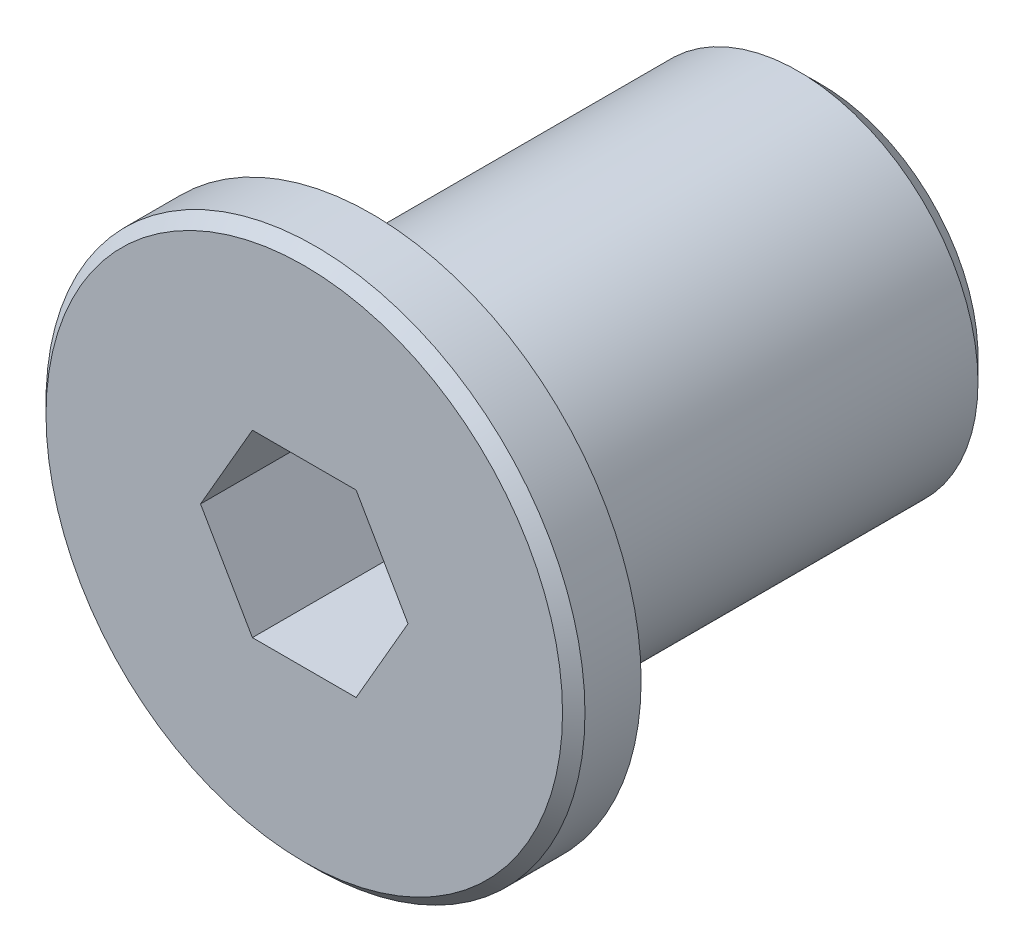
ISO-10303-21;
HEADER;
FILE_DESCRIPTION(('STEP AP214'),'2;1');
FILE_NAME('part.step','',(''),(''),'','','');
FILE_SCHEMA(('AUTOMOTIVE_DESIGN { 1 0 10303 214 1 1 1 1 }'));
ENDSEC;
DATA;
#1=APPLICATION_CONTEXT('core data for automotive mechanical design processes');
#2=APPLICATION_PROTOCOL_DEFINITION('international standard','automotive_design',2000,#1);
#3=PRODUCT_CONTEXT('',#1,'mechanical');
#4=PRODUCT('Part','Part','',(#3));
#5=PRODUCT_RELATED_PRODUCT_CATEGORY('part','',(#4));
#6=PRODUCT_DEFINITION_FORMATION('','',#4);
#7=PRODUCT_DEFINITION_CONTEXT('part definition',#1,'design');
#8=PRODUCT_DEFINITION('design','',#6,#7);
#9=PRODUCT_DEFINITION_SHAPE('','',#8);
#10=(LENGTH_UNIT() NAMED_UNIT(*) SI_UNIT(.MILLI.,.METRE.));
#11=(NAMED_UNIT(*) PLANE_ANGLE_UNIT() SI_UNIT($,.RADIAN.));
#12=(NAMED_UNIT(*) SI_UNIT($,.STERADIAN.) SOLID_ANGLE_UNIT());
#13=UNCERTAINTY_MEASURE_WITH_UNIT(LENGTH_MEASURE(1.E-05),#10,'distance_accuracy_value','');
#14=(GEOMETRIC_REPRESENTATION_CONTEXT(3) GLOBAL_UNCERTAINTY_ASSIGNED_CONTEXT((#13)) GLOBAL_UNIT_ASSIGNED_CONTEXT((#10,
#11,#12)) REPRESENTATION_CONTEXT('',''));
#15=CARTESIAN_POINT('',(0.,0.,0.));
#16=DIRECTION('',(0.,0.,1.));
#17=DIRECTION('',(1.,0.,0.));
#18=AXIS2_PLACEMENT_3D('',#15,#16,#17);
#19=CARTESIAN_POINT('',(0.,0.,-5.));
#20=DIRECTION('',(0.,0.,1.));
#21=DIRECTION('',(1.,0.,0.));
#22=AXIS2_PLACEMENT_3D('',#19,#20,#21);
#23=PLANE('',#22);
#24=DIRECTION('',(-0.499999999999999,0.866025403784439,0.));
#25=VECTOR('',#24,1.);
#26=CARTESIAN_POINT('',(1.73205080756888,1.,-5.));
#27=LINE('',#26,#25);
#28=CARTESIAN_POINT('',(1.73205080756888,1.,-5.));
#29=VERTEX_POINT('',#28);
#30=CARTESIAN_POINT('',(1.15470053837925,2.,-5.));
#31=VERTEX_POINT('',#30);
#32=EDGE_CURVE('E164',#29,#31,#27,.T.);
#33=ORIENTED_EDGE('',*,*,#32,.T.);
#34=DIRECTION('',(1.,0.,0.));
#35=VECTOR('',#34,1.);
#36=CARTESIAN_POINT('',(0.,2.,-5.));
#37=LINE('',#36,#35);
#38=CARTESIAN_POINT('',(0.,2.,-5.));
#39=VERTEX_POINT('',#38);
#40=EDGE_CURVE('E162',#31,#39,#37,.F.);
#41=ORIENTED_EDGE('',*,*,#40,.T.);
#42=CARTESIAN_POINT('',(0.,0.,-5.));
#43=DIRECTION('',(0.,0.,1.));
#44=DIRECTION('',(0.,-1.,0.));
#45=AXIS2_PLACEMENT_3D('',#42,#43,#44);
#46=CIRCLE('',#45,2.);
#47=EDGE_CURVE('E125',#39,#29,#46,.F.);
#48=ORIENTED_EDGE('',*,*,#47,.T.);
#49=EDGE_LOOP('',(#33,#41,#48));
#50=FACE_BOUND('',#49,.T.);
#51=ADVANCED_FACE('F15',(#50),#23,.T.);
#52=CARTESIAN_POINT('',(0.,0.,-5.));
#53=DIRECTION('',(0.,0.,1.));
#54=DIRECTION('',(1.,0.,0.));
#55=AXIS2_PLACEMENT_3D('',#52,#53,#54);
#56=PLANE('',#55);
#57=DIRECTION('',(0.5,0.866025403784439,0.));
#58=VECTOR('',#57,1.);
#59=CARTESIAN_POINT('',(1.73205080756888,-1.,-5.));
#60=LINE('',#59,#58);
#61=CARTESIAN_POINT('',(1.73205080756888,-1.,-5.));
#62=VERTEX_POINT('',#61);
#63=CARTESIAN_POINT('',(2.3094010767585,0.,-5.));
#64=VERTEX_POINT('',#63);
#65=EDGE_CURVE('E54',#62,#64,#60,.T.);
#66=ORIENTED_EDGE('',*,*,#65,.T.);
#67=DIRECTION('',(-0.5,0.866025403784438,0.));
#68=VECTOR('',#67,1.);
#69=CARTESIAN_POINT('',(2.3094010767585,0.,-5.));
#70=LINE('',#69,#68);
#71=EDGE_CURVE('E159',#64,#29,#70,.T.);
#72=ORIENTED_EDGE('',*,*,#71,.T.);
#73=CARTESIAN_POINT('',(0.,0.,-5.));
#74=DIRECTION('',(0.,0.,1.));
#75=DIRECTION('',(0.,-1.,0.));
#76=AXIS2_PLACEMENT_3D('',#73,#74,#75);
#77=CIRCLE('',#76,2.);
#78=EDGE_CURVE('E124',#29,#62,#77,.F.);
#79=ORIENTED_EDGE('',*,*,#78,.T.);
#80=EDGE_LOOP('',(#66,#72,#79));
#81=FACE_BOUND('',#80,.T.);
#82=ADVANCED_FACE('F313',(#81),#56,.T.);
#83=CARTESIAN_POINT('',(0.,0.,-5.));
#84=DIRECTION('',(0.,0.,1.));
#85=DIRECTION('',(1.,0.,0.));
#86=AXIS2_PLACEMENT_3D('',#83,#84,#85);
#87=PLANE('',#86);
#88=DIRECTION('',(0.499999999999999,-0.866025403784439,0.));
#89=VECTOR('',#88,1.);
#90=CARTESIAN_POINT('',(-1.73205080756888,-1.,-5.));
#91=LINE('',#90,#89);
#92=CARTESIAN_POINT('',(-1.73205080756888,-1.,-5.));
#93=VERTEX_POINT('',#92);
#94=CARTESIAN_POINT('',(-1.15470053837925,-2.,-5.));
#95=VERTEX_POINT('',#94);
#96=EDGE_CURVE('E156',#93,#95,#91,.T.);
#97=ORIENTED_EDGE('',*,*,#96,.T.);
#98=DIRECTION('',(1.,0.,0.));
#99=VECTOR('',#98,1.);
#100=CARTESIAN_POINT('',(0.,-2.,-5.));
#101=LINE('',#100,#99);
#102=CARTESIAN_POINT('',(0.,-2.,-5.));
#103=VERTEX_POINT('',#102);
#104=EDGE_CURVE('E154',#95,#103,#101,.T.);
#105=ORIENTED_EDGE('',*,*,#104,.T.);
#106=CARTESIAN_POINT('',(0.,0.,-5.));
#107=DIRECTION('',(0.,0.,1.));
#108=DIRECTION('',(0.,-1.,0.));
#109=AXIS2_PLACEMENT_3D('',#106,#107,#108);
#110=CIRCLE('',#109,2.);
#111=EDGE_CURVE('E121',#103,#93,#110,.F.);
#112=ORIENTED_EDGE('',*,*,#111,.T.);
#113=EDGE_LOOP('',(#97,#105,#112));
#114=FACE_BOUND('',#113,.T.);
#115=ADVANCED_FACE('F308',(#114),#87,.T.);
#116=CARTESIAN_POINT('',(0.,0.,-5.));
#117=DIRECTION('',(0.,0.,1.));
#118=DIRECTION('',(1.,0.,0.));
#119=AXIS2_PLACEMENT_3D('',#116,#117,#118);
#120=PLANE('',#119);
#121=DIRECTION('',(-0.5,-0.866025403784438,0.));
#122=VECTOR('',#121,1.);
#123=CARTESIAN_POINT('',(-1.73205080756888,1.,-5.));
#124=LINE('',#123,#122);
#125=CARTESIAN_POINT('',(-1.73205080756888,1.,-5.));
#126=VERTEX_POINT('',#125);
#127=CARTESIAN_POINT('',(-2.3094010767585,0.,-5.));
#128=VERTEX_POINT('',#127);
#129=EDGE_CURVE('E151',#126,#128,#124,.T.);
#130=ORIENTED_EDGE('',*,*,#129,.T.);
#131=DIRECTION('',(0.5,-0.866025403784438,0.));
#132=VECTOR('',#131,1.);
#133=CARTESIAN_POINT('',(-2.3094010767585,0.,-5.));
#134=LINE('',#133,#132);
#135=EDGE_CURVE('E139',#128,#93,#134,.T.);
#136=ORIENTED_EDGE('',*,*,#135,.T.);
#137=CARTESIAN_POINT('',(0.,0.,-5.));
#138=DIRECTION('',(0.,0.,1.));
#139=DIRECTION('',(0.,-1.,0.));
#140=AXIS2_PLACEMENT_3D('',#137,#138,#139);
#141=CIRCLE('',#140,2.);
#142=EDGE_CURVE('E116',#93,#126,#141,.F.);
#143=ORIENTED_EDGE('',*,*,#142,.T.);
#144=EDGE_LOOP('',(#130,#136,#143));
#145=FACE_BOUND('',#144,.T.);
#146=ADVANCED_FACE('F306',(#145),#120,.T.);
#147=CARTESIAN_POINT('',(0.,0.,-5.));
#148=DIRECTION('',(0.,0.,1.));
#149=DIRECTION('',(1.,0.,0.));
#150=AXIS2_PLACEMENT_3D('',#147,#148,#149);
#151=PLANE('',#150);
#152=DIRECTION('',(1.,0.,0.));
#153=VECTOR('',#152,1.);
#154=CARTESIAN_POINT('',(0.,2.,-5.));
#155=LINE('',#154,#153);
#156=CARTESIAN_POINT('',(-1.15470053837925,2.,-5.));
#157=VERTEX_POINT('',#156);
#158=EDGE_CURVE('E134',#39,#157,#155,.F.);
#159=ORIENTED_EDGE('',*,*,#158,.T.);
#160=DIRECTION('',(-0.5,-0.866025403784439,0.));
#161=VECTOR('',#160,1.);
#162=CARTESIAN_POINT('',(-1.15470053837925,2.,-5.));
#163=LINE('',#162,#161);
#164=EDGE_CURVE('E127',#157,#126,#163,.T.);
#165=ORIENTED_EDGE('',*,*,#164,.T.);
#166=CARTESIAN_POINT('',(0.,0.,-5.));
#167=DIRECTION('',(0.,0.,1.));
#168=DIRECTION('',(0.,-1.,0.));
#169=AXIS2_PLACEMENT_3D('',#166,#167,#168);
#170=CIRCLE('',#169,2.);
#171=EDGE_CURVE('E113',#126,#39,#170,.F.);
#172=ORIENTED_EDGE('',*,*,#171,.T.);
#173=EDGE_LOOP('',(#159,#165,#172));
#174=FACE_BOUND('',#173,.T.);
#175=ADVANCED_FACE('F287',(#174),#151,.T.);
#176=CARTESIAN_POINT('',(0.,0.250000000000001,-6.5));
#177=DIRECTION('',(0.,0.,-1.));
#178=DIRECTION('',(-1.,0.,0.));
#179=AXIS2_PLACEMENT_3D('',#176,#177,#178);
#180=PLANE('',#179);
#181=CARTESIAN_POINT('',(0.,0.,-6.5));
#182=DIRECTION('',(0.,0.,1.));
#183=DIRECTION('',(0.,-1.,0.));
#184=AXIS2_PLACEMENT_3D('',#181,#182,#183);
#185=CIRCLE('',#184,0.500000000000001);
#186=CARTESIAN_POINT('',(0.,0.500000000000001,-6.5));
#187=VERTEX_POINT('',#186);
#188=EDGE_CURVE('E60',#187,#187,#185,.T.);
#189=ORIENTED_EDGE('',*,*,#188,.T.);
#190=EDGE_LOOP('',(#189));
#191=FACE_BOUND('',#190,.T.);
#192=ADVANCED_FACE('F271',(#191),#180,.F.);
#193=CARTESIAN_POINT('',(0.,2.,-5.));
#194=CARTESIAN_POINT('',(0.,1.47070709916903,-6.19091513246404));
#195=CARTESIAN_POINT('',(0.,0.500000000000001,-6.5));
#196=(BOUNDED_CURVE() B_SPLINE_CURVE(2,(#193,#194,#195),.UNSPECIFIED.,.F.,
.F.) B_SPLINE_CURVE_WITH_KNOTS((3,3),(0.,0.459388320020566),
.UNSPECIFIED.) CURVE() GEOMETRIC_REPRESENTATION_ITEM() RATIONAL_B_SPLINE_CURVE((1.,1.,1.)) REPRESENTATION_ITEM(''));
#197=CARTESIAN_POINT('',(0.,0.,-6.5));
#198=DIRECTION('',(0.,0.,1.));
#199=AXIS1_PLACEMENT('',#197,#198);
#200=SURFACE_OF_REVOLUTION('',#196,#199);
#201=ORIENTED_EDGE('',*,*,#188,.F.);
#202=CARTESIAN_POINT('',(0.,2.,-5.));
#203=CARTESIAN_POINT('',(0.,1.97827182619173,-5.04888240871449));
#204=CARTESIAN_POINT('',(0.,1.95566558006333,-5.09738320406536));
#205=CARTESIAN_POINT('',(0.,1.90924750218105,-5.19205941996444));
#206=CARTESIAN_POINT('',(0.,1.88548984352403,-5.23826144832604));
#207=CARTESIAN_POINT('',(0.,1.83677019123873,-5.32834337707176));
#208=CARTESIAN_POINT('',(0.,1.81186145011461,-5.3722519744186));
#209=CARTESIAN_POINT('',(0.,1.76084050483905,-5.45774340043139));
#210=CARTESIAN_POINT('',(0.,1.73477996335951,-5.49935699073731));
#211=CARTESIAN_POINT('',(0.,1.6814572947538,-5.58025681634127));
#212=CARTESIAN_POINT('',(0.,1.65424445703679,-5.61957545842493));
#213=CARTESIAN_POINT('',(0.,1.59861983381496,-5.69588374907246));
#214=CARTESIAN_POINT('',(0.,1.57025413740641,-5.73290691641974));
#215=CARTESIAN_POINT('',(0.,1.51232729538913,-5.80462334879223));
#216=CARTESIAN_POINT('',(0.,1.48280819753971,-5.83935050128348));
#217=CARTESIAN_POINT('',(0.,1.42257900760656,-5.90647470967855));
#218=CARTESIAN_POINT('',(0.,1.39190612070068,-5.93890508238314));
#219=CARTESIAN_POINT('',(0.,1.32937429317669,-6.00143673695821));
#220=CARTESIAN_POINT('',(0.,1.29754703010189,-6.03156963172105));
#221=CARTESIAN_POINT('',(0.,1.23271325795719,-6.08950782814783));
#222=CARTESIAN_POINT('',(0.,1.1997323684979,-6.11734177070918));
#223=CARTESIAN_POINT('',(0.,1.13259429865741,-6.17068740496834));
#224=CARTESIAN_POINT('',(0.,1.09845647742931,-6.19622336773438));
#225=CARTESIAN_POINT('',(0.,1.0462714232118,-6.23286121671812));
#226=CARTESIAN_POINT('',(0.,1.02877692942351,-6.24475698448814));
#227=CARTESIAN_POINT('',(0.,0.993498546966384,-6.26797271454702));
#228=CARTESIAN_POINT('',(0.,0.975715914658029,-6.2792945811534));
#229=CARTESIAN_POINT('',(0.,0.939862259026094,-6.30136231719819));
#230=CARTESIAN_POINT('',(0.,0.921792130786073,-6.31210964156172));
#231=CARTESIAN_POINT('',(0.,0.885363675176823,-6.33302891879935));
#232=CARTESIAN_POINT('',(0.,0.867005905754607,-6.34320184299462));
#233=CARTESIAN_POINT('',(0.,0.830002547961604,-6.36297276652363));
#234=CARTESIAN_POINT('',(0.,0.811357206016257,-6.37257122706531));
#235=CARTESIAN_POINT('',(0.,0.773778999499796,-6.3911937540134));
#236=CARTESIAN_POINT('',(0.,0.754846099952507,-6.40021774984228));
#237=CARTESIAN_POINT('',(0.,0.716693057730008,-6.41769187140308));
#238=CARTESIAN_POINT('',(0.,0.697472632008254,-6.4261413790729));
#239=CARTESIAN_POINT('',(0.,0.658744780295542,-6.44246710936987));
#240=CARTESIAN_POINT('',(0.,0.639236859070804,-6.45034215707015));
#241=CARTESIAN_POINT('',(0.,0.599934216251847,-6.46551939673935));
#242=CARTESIAN_POINT('',(0.,0.580138824832327,-6.47281985347101));
#243=CARTESIAN_POINT('',(0.,0.540261429737367,-6.48684894907975));
#244=CARTESIAN_POINT('',(0.,0.520178620235151,-6.49357529786835));
#245=CARTESIAN_POINT('',(0.,0.500000000000001,-6.5));
#246=B_SPLINE_CURVE_WITH_KNOTS('',3,(#202,#203,#204,#205,#206,#207,#208,#209,#210,#211,#212,
#213,#214,#215,#216,#217,#218,#219,#220,#221,#222,#223,#224,#225,#226,#227,#228,#229,#230,#231,
#232,#233,#234,#235,#236,#237,#238,#239,#240,#241,#242,#243,#244,#245),.UNSPECIFIED.,.F.,.F.,(4,
2,2,2,2,2,2,2,2,2,2,2,2,2,2,2,2,2,2,2,2,4),(0.,0.160484874729874,0.31630299090354,
0.467702744837059,0.614954894249969,0.758353692622503,0.898217716213365,1.03489026161929,
1.16873918426277,1.3001560529299,1.4295545169861,1.55736782412704,1.62082716949787,
1.68405992592196,1.74712412987997,1.81007828401216,1.87298119801393,1.93589182528073,
1.99886909754671,2.06197175982651,2.12525820795964,2.1887863309729),.UNSPECIFIED.);
#247=EDGE_CURVE('E110',#39,#187,#246,.T.);
#248=ORIENTED_EDGE('',*,*,#247,.F.);
#249=ORIENTED_EDGE('',*,*,#171,.F.);
#250=ORIENTED_EDGE('',*,*,#142,.F.);
#251=ORIENTED_EDGE('',*,*,#111,.F.);
#252=CARTESIAN_POINT('',(0.,0.,-5.));
#253=DIRECTION('',(0.,0.,1.));
#254=DIRECTION('',(0.,-1.,0.));
#255=AXIS2_PLACEMENT_3D('',#252,#253,#254);
#256=CIRCLE('',#255,2.);
#257=EDGE_CURVE('E105',#62,#103,#256,.F.);
#258=ORIENTED_EDGE('',*,*,#257,.F.);
#259=ORIENTED_EDGE('',*,*,#78,.F.);
#260=ORIENTED_EDGE('',*,*,#47,.F.);
#261=ORIENTED_EDGE('',*,*,#247,.T.);
#262=EDGE_LOOP('',(#201,#248,#249,#250,#251,#258,#259,#260,#261));
#263=FACE_BOUND('',#262,.T.);
#264=ADVANCED_FACE('F265',(#263),#200,.T.);
#265=CARTESIAN_POINT('',(0.,0.,-5.));
#266=DIRECTION('',(0.,0.,1.));
#267=DIRECTION('',(1.,0.,0.));
#268=AXIS2_PLACEMENT_3D('',#265,#266,#267);
#269=PLANE('',#268);
#270=DIRECTION('',(1.,0.,0.));
#271=VECTOR('',#270,1.);
#272=CARTESIAN_POINT('',(-1.15470053837925,-2.,-5.));
#273=LINE('',#272,#271);
#274=CARTESIAN_POINT('',(1.15470053837925,-2.,-5.));
#275=VERTEX_POINT('',#274);
#276=EDGE_CURVE('E180',#103,#275,#273,.T.);
#277=ORIENTED_EDGE('',*,*,#276,.T.);
#278=DIRECTION('',(0.5,0.866025403784439,0.));
#279=VECTOR('',#278,1.);
#280=CARTESIAN_POINT('',(1.15470053837925,-2.,-5.));
#281=LINE('',#280,#279);
#282=EDGE_CURVE('E108',#275,#62,#281,.T.);
#283=ORIENTED_EDGE('',*,*,#282,.T.);
#284=ORIENTED_EDGE('',*,*,#257,.T.);
#285=EDGE_LOOP('',(#277,#283,#284));
#286=FACE_BOUND('',#285,.T.);
#287=ADVANCED_FACE('F270',(#286),#269,.T.);
#288=CARTESIAN_POINT('',(-2.3094010767585,0.,0.));
#289=DIRECTION('',(-0.866025403784439,-0.5,0.));
#290=DIRECTION('',(0.5,-0.866025403784439,0.));
#291=AXIS2_PLACEMENT_3D('',#288,#289,#290);
#292=PLANE('',#291);
#293=DIRECTION('',(0.,0.,1.));
#294=VECTOR('',#293,1.);
#295=CARTESIAN_POINT('',(-2.3094010767585,0.,0.));
#296=LINE('',#295,#294);
#297=CARTESIAN_POINT('',(-2.3094010767585,0.,0.));
#298=VERTEX_POINT('',#297);
#299=EDGE_CURVE('E172',#128,#298,#296,.T.);
#300=ORIENTED_EDGE('',*,*,#299,.T.);
#301=DIRECTION('',(0.5,-0.866025403784439,0.));
#302=VECTOR('',#301,1.);
#303=CARTESIAN_POINT('',(-2.3094010767585,0.,0.));
#304=LINE('',#303,#302);
#305=CARTESIAN_POINT('',(-1.15470053837925,-2.,0.));
#306=VERTEX_POINT('',#305);
#307=EDGE_CURVE('E171',#298,#306,#304,.T.);
#308=ORIENTED_EDGE('',*,*,#307,.T.);
#309=DIRECTION('',(0.,0.,-1.));
#310=VECTOR('',#309,1.);
#311=CARTESIAN_POINT('',(-1.15470053837925,-2.,0.));
#312=LINE('',#311,#310);
#313=EDGE_CURVE('E176',#306,#95,#312,.T.);
#314=ORIENTED_EDGE('',*,*,#313,.T.);
#315=ORIENTED_EDGE('',*,*,#96,.F.);
#316=ORIENTED_EDGE('',*,*,#135,.F.);
#317=EDGE_LOOP('',(#300,#308,#314,#315,#316));
#318=FACE_BOUND('',#317,.T.);
#319=ADVANCED_FACE('F228',(#318),#292,.F.);
#320=CARTESIAN_POINT('',(-1.15470053837925,-2.,0.));
#321=DIRECTION('',(0.,-1.,0.));
#322=DIRECTION('',(0.,0.,-1.));
#323=AXIS2_PLACEMENT_3D('',#320,#321,#322);
#324=PLANE('',#323);
#325=ORIENTED_EDGE('',*,*,#313,.F.);
#326=DIRECTION('',(-1.,0.,0.));
#327=VECTOR('',#326,1.);
#328=CARTESIAN_POINT('',(0.,-2.,0.));
#329=LINE('',#328,#327);
#330=CARTESIAN_POINT('',(1.15470053837925,-2.,0.));
#331=VERTEX_POINT('',#330);
#332=EDGE_CURVE('E234',#306,#331,#329,.F.);
#333=ORIENTED_EDGE('',*,*,#332,.T.);
#334=DIRECTION('',(0.,0.,1.));
#335=VECTOR('',#334,1.);
#336=CARTESIAN_POINT('',(1.15470053837925,-2.,0.));
#337=LINE('',#336,#335);
#338=EDGE_CURVE('E179',#331,#275,#337,.F.);
#339=ORIENTED_EDGE('',*,*,#338,.T.);
#340=ORIENTED_EDGE('',*,*,#276,.F.);
#341=ORIENTED_EDGE('',*,*,#104,.F.);
#342=EDGE_LOOP('',(#325,#333,#339,#340,#341));
#343=FACE_BOUND('',#342,.T.);
#344=ADVANCED_FACE('F237',(#343),#324,.F.);
#345=CARTESIAN_POINT('',(1.15470053837925,-2.,0.));
#346=DIRECTION('',(0.866025403784439,-0.5,0.));
#347=DIRECTION('',(0.5,0.866025403784439,0.));
#348=AXIS2_PLACEMENT_3D('',#345,#346,#347);
#349=PLANE('',#348);
#350=ORIENTED_EDGE('',*,*,#338,.F.);
#351=DIRECTION('',(0.5,0.866025403784439,0.));
#352=VECTOR('',#351,1.);
#353=CARTESIAN_POINT('',(1.15470053837925,-2.,0.));
#354=LINE('',#353,#352);
#355=CARTESIAN_POINT('',(2.3094010767585,0.,0.));
#356=VERTEX_POINT('',#355);
#357=EDGE_CURVE('E245',#331,#356,#354,.T.);
#358=ORIENTED_EDGE('',*,*,#357,.T.);
#359=DIRECTION('',(0.,0.,1.));
#360=VECTOR('',#359,1.);
#361=CARTESIAN_POINT('',(2.3094010767585,0.,0.));
#362=LINE('',#361,#360);
#363=EDGE_CURVE('E181',#356,#64,#362,.F.);
#364=ORIENTED_EDGE('',*,*,#363,.T.);
#365=ORIENTED_EDGE('',*,*,#65,.F.);
#366=ORIENTED_EDGE('',*,*,#282,.F.);
#367=EDGE_LOOP('',(#350,#358,#364,#365,#366));
#368=FACE_BOUND('',#367,.T.);
#369=ADVANCED_FACE('F311',(#368),#349,.F.);
#370=CARTESIAN_POINT('',(2.3094010767585,0.,0.));
#371=DIRECTION('',(0.866025403784439,0.5,0.));
#372=DIRECTION('',(-0.5,0.866025403784439,0.));
#373=AXIS2_PLACEMENT_3D('',#370,#371,#372);
#374=PLANE('',#373);
#375=ORIENTED_EDGE('',*,*,#363,.F.);
#376=DIRECTION('',(-0.5,0.866025403784439,0.));
#377=VECTOR('',#376,1.);
#378=CARTESIAN_POINT('',(2.3094010767585,0.,0.));
#379=LINE('',#378,#377);
#380=CARTESIAN_POINT('',(1.15470053837925,2.,0.));
#381=VERTEX_POINT('',#380);
#382=EDGE_CURVE('E247',#356,#381,#379,.T.);
#383=ORIENTED_EDGE('',*,*,#382,.T.);
#384=DIRECTION('',(0.,0.,1.));
#385=VECTOR('',#384,1.);
#386=CARTESIAN_POINT('',(1.15470053837925,2.,0.));
#387=LINE('',#386,#385);
#388=EDGE_CURVE('E175',#381,#31,#387,.F.);
#389=ORIENTED_EDGE('',*,*,#388,.T.);
#390=ORIENTED_EDGE('',*,*,#32,.F.);
#391=ORIENTED_EDGE('',*,*,#71,.F.);
#392=EDGE_LOOP('',(#375,#383,#389,#390,#391));
#393=FACE_BOUND('',#392,.T.);
#394=ADVANCED_FACE('F295',(#393),#374,.F.);
#395=CARTESIAN_POINT('',(1.15470053837925,2.,0.));
#396=DIRECTION('',(0.,1.,0.));
#397=DIRECTION('',(0.,0.,1.));
#398=AXIS2_PLACEMENT_3D('',#395,#396,#397);
#399=PLANE('',#398);
#400=ORIENTED_EDGE('',*,*,#388,.F.);
#401=DIRECTION('',(-1.,0.,0.));
#402=VECTOR('',#401,1.);
#403=CARTESIAN_POINT('',(0.,2.,0.));
#404=LINE('',#403,#402);
#405=CARTESIAN_POINT('',(-1.15470053837925,2.,0.));
#406=VERTEX_POINT('',#405);
#407=EDGE_CURVE('E296',#381,#406,#404,.T.);
#408=ORIENTED_EDGE('',*,*,#407,.T.);
#409=DIRECTION('',(0.,0.,1.));
#410=VECTOR('',#409,1.);
#411=CARTESIAN_POINT('',(-1.15470053837925,2.,0.));
#412=LINE('',#411,#410);
#413=EDGE_CURVE('E168',#406,#157,#412,.F.);
#414=ORIENTED_EDGE('',*,*,#413,.T.);
#415=ORIENTED_EDGE('',*,*,#158,.F.);
#416=ORIENTED_EDGE('',*,*,#40,.F.);
#417=EDGE_LOOP('',(#400,#408,#414,#415,#416));
#418=FACE_BOUND('',#417,.T.);
#419=ADVANCED_FACE('F290',(#418),#399,.F.);
#420=CARTESIAN_POINT('',(-1.15470053837925,2.,0.));
#421=DIRECTION('',(-0.866025403784439,0.5,0.));
#422=DIRECTION('',(-0.5,-0.866025403784439,0.));
#423=AXIS2_PLACEMENT_3D('',#420,#421,#422);
#424=PLANE('',#423);
#425=ORIENTED_EDGE('',*,*,#413,.F.);
#426=DIRECTION('',(-0.5,-0.866025403784439,0.));
#427=VECTOR('',#426,1.);
#428=CARTESIAN_POINT('',(-1.15470053837925,2.,0.));
#429=LINE('',#428,#427);
#430=EDGE_CURVE('E104',#406,#298,#429,.T.);
#431=ORIENTED_EDGE('',*,*,#430,.T.);
#432=ORIENTED_EDGE('',*,*,#299,.F.);
#433=ORIENTED_EDGE('',*,*,#129,.F.);
#434=ORIENTED_EDGE('',*,*,#164,.F.);
#435=EDGE_LOOP('',(#425,#431,#432,#433,#434));
#436=FACE_BOUND('',#435,.T.);
#437=ADVANCED_FACE('F304',(#436),#424,.F.);
#438=CARTESIAN_POINT('',(0.,0.,0.));
#439=DIRECTION('',(0.,0.,-1.));
#440=DIRECTION('',(-1.,0.,0.));
#441=AXIS2_PLACEMENT_3D('',#438,#439,#440);
#442=PLANE('',#441);
#443=ORIENTED_EDGE('',*,*,#407,.F.);
#444=ORIENTED_EDGE('',*,*,#382,.F.);
#445=ORIENTED_EDGE('',*,*,#357,.F.);
#446=ORIENTED_EDGE('',*,*,#332,.F.);
#447=ORIENTED_EDGE('',*,*,#307,.F.);
#448=ORIENTED_EDGE('',*,*,#430,.F.);
#449=EDGE_LOOP('',(#443,#444,#445,#446,#447,#448));
#450=FACE_BOUND('',#449,.T.);
#451=CARTESIAN_POINT('',(0.,0.,1.13686837721616E-10));
#452=DIRECTION('',(0.,0.,-1.));
#453=DIRECTION('',(-1.,0.,0.));
#454=AXIS2_PLACEMENT_3D('',#451,#452,#453);
#455=CIRCLE('',#454,5.7500000000914);
#456=CARTESIAN_POINT('',(5.7500000000914,0.,1.13686837721616E-10));
#457=VERTEX_POINT('',#456);
#458=EDGE_CURVE('E31',#457,#457,#455,.T.);
#459=ORIENTED_EDGE('',*,*,#458,.F.);
#460=EDGE_LOOP('',(#459));
#461=FACE_BOUND('',#460,.T.);
#462=ADVANCED_FACE('F243',(#450,#461),#442,.F.);
#463=CARTESIAN_POINT('',(0.,0.,-0.250000000164619));
#464=DIRECTION('',(0.,0.,-1.));
#465=DIRECTION('',(-1.,0.,0.));
#466=AXIS2_PLACEMENT_3D('',#463,#464,#465);
#467=CONICAL_SURFACE('',#466,5.99999999991496,0.785398162487954);
#468=CARTESIAN_POINT('',(0.,0.,-0.25));
#469=DIRECTION('',(0.,0.,-1.));
#470=DIRECTION('',(-1.,0.,0.));
#471=AXIS2_PLACEMENT_3D('',#468,#469,#470);
#472=CIRCLE('',#471,6.);
#473=CARTESIAN_POINT('',(5.99999999995748,0.,-0.250000000082309));
#474=VERTEX_POINT('',#473);
#475=EDGE_CURVE('E96',#474,#474,#472,.T.);
#476=ORIENTED_EDGE('',*,*,#475,.F.);
#477=EDGE_LOOP('',(#476));
#478=FACE_BOUND('',#477,.T.);
#479=ORIENTED_EDGE('',*,*,#458,.T.);
#480=EDGE_LOOP('',(#479));
#481=FACE_BOUND('',#480,.T.);
#482=ADVANCED_FACE('F381',(#478,#481),#467,.T.);
#483=CARTESIAN_POINT('',(0.,0.,0.));
#484=DIRECTION('',(0.,0.,-1.));
#485=DIRECTION('',(-1.,0.,0.));
#486=AXIS2_PLACEMENT_3D('',#483,#484,#485);
#487=CYLINDRICAL_SURFACE('',#486,6.);
#488=ORIENTED_EDGE('',*,*,#475,.T.);
#489=EDGE_LOOP('',(#488));
#490=FACE_BOUND('',#489,.T.);
#491=CARTESIAN_POINT('',(0.,0.,-1.5));
#492=DIRECTION('',(0.,0.,-1.));
#493=DIRECTION('',(-1.,0.,0.));
#494=AXIS2_PLACEMENT_3D('',#491,#492,#493);
#495=CIRCLE('',#494,6.);
#496=CARTESIAN_POINT('',(6.,0.,-1.5));
#497=VERTEX_POINT('',#496);
#498=EDGE_CURVE('E93',#497,#497,#495,.T.);
#499=ORIENTED_EDGE('',*,*,#498,.F.);
#500=EDGE_LOOP('',(#499));
#501=FACE_BOUND('',#500,.T.);
#502=ADVANCED_FACE('F94',(#490,#501),#487,.T.);
#503=CARTESIAN_POINT('',(0.,0.,-11.5));
#504=DIRECTION('',(0.,0.,1.));
#505=DIRECTION('',(1.,0.,0.));
#506=AXIS2_PLACEMENT_3D('',#503,#504,#505);
#507=PLANE('',#506);
#508=CARTESIAN_POINT('',(0.,0.,-11.5000000001828));
#509=DIRECTION('',(0.,0.,1.));
#510=DIRECTION('',(1.,0.,0.));
#511=AXIS2_PLACEMENT_3D('',#508,#509,#510);
#512=CIRCLE('',#511,3.50000000020145);
#513=CARTESIAN_POINT('',(-3.50000000020145,0.,-11.5000000001828));
#514=VERTEX_POINT('',#513);
#515=EDGE_CURVE('E89',#514,#514,#512,.T.);
#516=ORIENTED_EDGE('',*,*,#515,.F.);
#517=EDGE_LOOP('',(#516));
#518=FACE_BOUND('',#517,.T.);
#519=ADVANCED_FACE('F191',(#518),#507,.F.);
#520=CARTESIAN_POINT('',(0.,0.,-1.5));
#521=DIRECTION('',(0.,0.,-1.));
#522=DIRECTION('',(-1.,0.,0.));
#523=AXIS2_PLACEMENT_3D('',#520,#521,#522);
#524=PLANE('',#523);
#525=CARTESIAN_POINT('',(0.,0.,-1.5));
#526=DIRECTION('',(0.,0.,-1.));
#527=DIRECTION('',(-1.,0.,0.));
#528=AXIS2_PLACEMENT_3D('',#525,#526,#527);
#529=CIRCLE('',#528,4.);
#530=CARTESIAN_POINT('',(-4.,0.,-1.5));
#531=VERTEX_POINT('',#530);
#532=EDGE_CURVE('E24',#531,#531,#529,.T.);
#533=ORIENTED_EDGE('',*,*,#532,.F.);
#534=EDGE_LOOP('',(#533));
#535=FACE_BOUND('',#534,.T.);
#536=ORIENTED_EDGE('',*,*,#498,.T.);
#537=EDGE_LOOP('',(#536));
#538=FACE_BOUND('',#537,.T.);
#539=ADVANCED_FACE('F188',(#535,#538),#524,.T.);
#540=CARTESIAN_POINT('',(0.,0.,-10.999999999683));
#541=DIRECTION('',(0.,0.,1.));
#542=DIRECTION('',(1.,0.,0.));
#543=AXIS2_PLACEMENT_3D('',#540,#541,#542);
#544=CONICAL_SURFACE('',#543,3.99999999984857,0.785398162544797);
#545=CARTESIAN_POINT('',(0.,0.,-11.));
#546=DIRECTION('',(0.,0.,-1.));
#547=DIRECTION('',(-1.,0.,0.));
#548=AXIS2_PLACEMENT_3D('',#545,#546,#547);
#549=CIRCLE('',#548,4.);
#550=CARTESIAN_POINT('',(-3.99999999989586,0.,-10.9999999998699));
#551=VERTEX_POINT('',#550);
#552=EDGE_CURVE('E9',#551,#551,#549,.F.);
#553=ORIENTED_EDGE('',*,*,#552,.F.);
#554=EDGE_LOOP('',(#553));
#555=FACE_BOUND('',#554,.T.);
#556=ORIENTED_EDGE('',*,*,#515,.T.);
#557=EDGE_LOOP('',(#556));
#558=FACE_BOUND('',#557,.T.);
#559=ADVANCED_FACE('F190',(#555,#558),#544,.T.);
#560=CARTESIAN_POINT('',(0.,0.,-1.5));
#561=DIRECTION('',(0.,0.,-1.));
#562=DIRECTION('',(-1.,0.,0.));
#563=AXIS2_PLACEMENT_3D('',#560,#561,#562);
#564=CYLINDRICAL_SURFACE('',#563,4.);
#565=ORIENTED_EDGE('',*,*,#552,.T.);
#566=EDGE_LOOP('',(#565));
#567=FACE_BOUND('',#566,.T.);
#568=ORIENTED_EDGE('',*,*,#532,.T.);
#569=EDGE_LOOP('',(#568));
#570=FACE_BOUND('',#569,.T.);
#571=ADVANCED_FACE('F186',(#567,#570),#564,.T.);
#572=CLOSED_SHELL('',(#51,#82,#115,#146,#175,#192,#264,#287,#319,#344,#369,#394,#419,#437,#462,
#482,#502,#519,#539,#559,#571));
#573=MANIFOLD_SOLID_BREP('B1',#572);
#574=ADVANCED_BREP_SHAPE_REPRESENTATION('',(#18,#573),#14);
#575=SHAPE_DEFINITION_REPRESENTATION(#9,#574);
ENDSEC;
END-ISO-10303-21;
